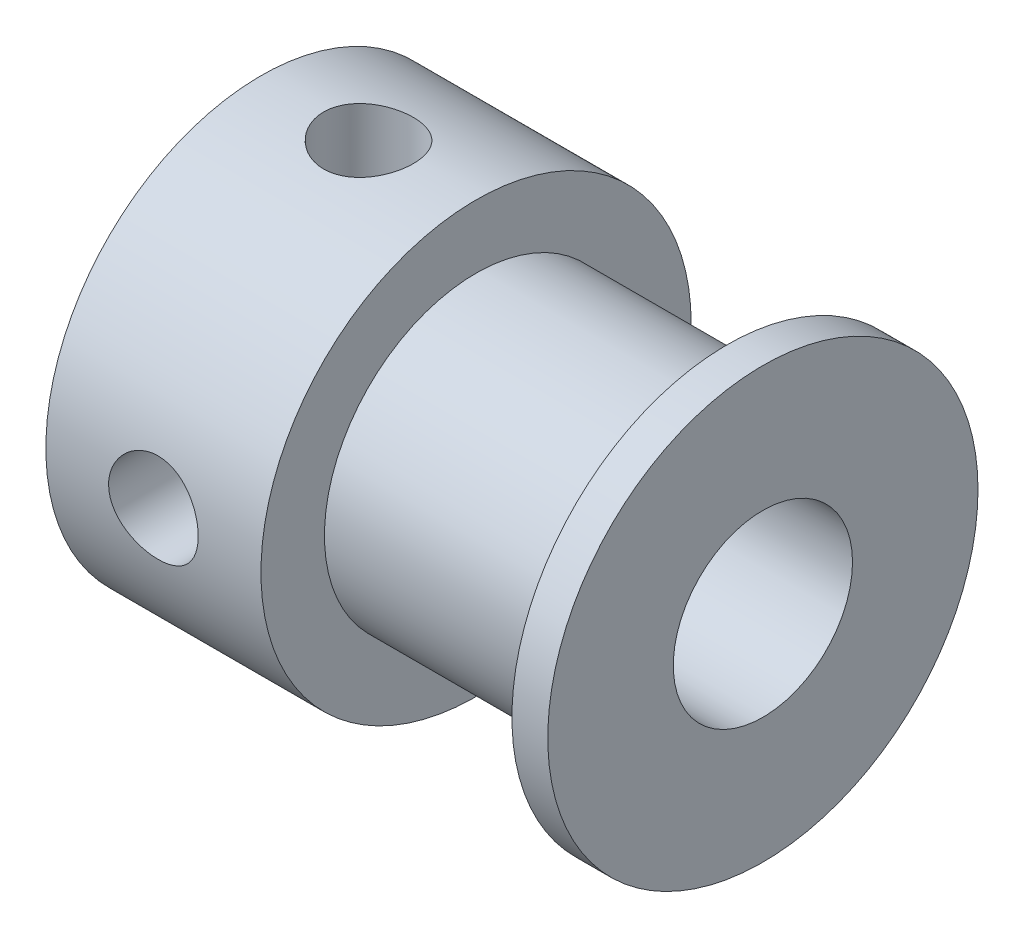
ISO-10303-21;
HEADER;
FILE_DESCRIPTION(('STEP AP214'),'2;1');
FILE_NAME('part.step','',(''),(''),'','','');
FILE_SCHEMA(('AUTOMOTIVE_DESIGN { 1 0 10303 214 1 1 1 1 }'));
ENDSEC;
DATA;
#1=APPLICATION_CONTEXT('core data for automotive mechanical design processes');
#2=APPLICATION_PROTOCOL_DEFINITION('international standard','automotive_design',2000,#1);
#3=PRODUCT_CONTEXT('',#1,'mechanical');
#4=PRODUCT('Part','Part','',(#3));
#5=PRODUCT_RELATED_PRODUCT_CATEGORY('part','',(#4));
#6=PRODUCT_DEFINITION_FORMATION('','',#4);
#7=PRODUCT_DEFINITION_CONTEXT('part definition',#1,'design');
#8=PRODUCT_DEFINITION('design','',#6,#7);
#9=PRODUCT_DEFINITION_SHAPE('','',#8);
#10=(LENGTH_UNIT() NAMED_UNIT(*) SI_UNIT(.MILLI.,.METRE.));
#11=(NAMED_UNIT(*) PLANE_ANGLE_UNIT() SI_UNIT($,.RADIAN.));
#12=(NAMED_UNIT(*) SI_UNIT($,.STERADIAN.) SOLID_ANGLE_UNIT());
#13=UNCERTAINTY_MEASURE_WITH_UNIT(LENGTH_MEASURE(1.E-05),#10,'distance_accuracy_value','');
#14=(GEOMETRIC_REPRESENTATION_CONTEXT(3) GLOBAL_UNCERTAINTY_ASSIGNED_CONTEXT((#13)) GLOBAL_UNIT_ASSIGNED_CONTEXT((#10,
#11,#12)) REPRESENTATION_CONTEXT('',''));
#15=CARTESIAN_POINT('',(0.,0.,0.));
#16=DIRECTION('',(0.,0.,1.));
#17=DIRECTION('',(1.,0.,0.));
#18=AXIS2_PLACEMENT_3D('',#15,#16,#17);
#19=CARTESIAN_POINT('',(0.,0.,0.));
#20=DIRECTION('',(1.,0.,0.));
#21=DIRECTION('',(0.,0.,-1.));
#22=AXIS2_PLACEMENT_3D('',#19,#20,#21);
#23=CYLINDRICAL_SURFACE('',#22,2.5);
#24=CARTESIAN_POINT('',(1.75000000000001,0.,2.5));
#25=CARTESIAN_POINT('',(1.75000412789938,0.0657149536912327,2.49999641755189));
#26=CARTESIAN_POINT('',(1.7552125914021,0.13150824962254,2.49738113774397));
#27=CARTESIAN_POINT('',(1.77581610042615,0.26115029408553,2.48717695046745));
#28=CARTESIAN_POINT('',(1.79123049124707,0.324995108391878,2.4795785978623));
#29=CARTESIAN_POINT('',(1.831492260771,0.448666931100716,2.4602034925414));
#30=CARTESIAN_POINT('',(1.85630298031002,0.508508503673972,2.448442989719));
#31=CARTESIAN_POINT('',(1.91446327670618,0.623090771008203,2.42182220644723));
#32=CARTESIAN_POINT('',(1.94781218031107,0.677831867487559,2.40696217041913));
#33=CARTESIAN_POINT('',(2.02439656185663,0.784384772202394,2.37445322822571));
#34=CARTESIAN_POINT('',(2.06810809904956,0.835819013902635,2.3566899890942));
#35=CARTESIAN_POINT('',(2.1631518490588,0.930974306083716,2.32074962808431));
#36=CARTESIAN_POINT('',(2.21448981471555,0.974689478883452,2.30257220261294));
#37=CARTESIAN_POINT('',(2.32810418690423,1.05656500056284,2.26623688996684));
#38=CARTESIAN_POINT('',(2.39092012293239,1.09403166943954,2.24818983712665));
#39=CARTESIAN_POINT('',(2.52295916998277,1.15771028361336,2.21607473465401));
#40=CARTESIAN_POINT('',(2.59217766090344,1.18393026870791,2.20200384508737));
#41=CARTESIAN_POINT('',(2.73083138177741,1.22266555273573,2.18072333797261));
#42=CARTESIAN_POINT('',(2.80000556508424,1.23590732135054,2.17315339479642));
#43=CARTESIAN_POINT('',(2.93997354722435,1.25053374163605,2.1647736243566));
#44=CARTESIAN_POINT('',(3.01076567608894,1.25193011046634,2.16395711679111));
#45=CARTESIAN_POINT('',(3.14285753039421,1.24335910896536,2.16888662821561));
#46=CARTESIAN_POINT('',(3.20428003902881,1.23473069942102,2.17385954577517));
#47=CARTESIAN_POINT('',(3.3246523867163,1.20867481132116,2.18845285917313));
#48=CARTESIAN_POINT('',(3.38360143163164,1.19124452987206,2.19807473539721));
#49=CARTESIAN_POINT('',(3.49903641570707,1.1477622254825,2.22109345515927));
#50=CARTESIAN_POINT('',(3.55543299848223,1.12151883389499,2.23457300829999));
#51=CARTESIAN_POINT('',(3.66329286573751,1.061302109585,2.26379255351755));
#52=CARTESIAN_POINT('',(3.71475391950011,1.02732530476558,2.27953355975239));
#53=CARTESIAN_POINT('',(3.81815156592903,0.94758256864098,2.31391447379108));
#54=CARTESIAN_POINT('',(3.86932109197019,0.900868072961596,2.33266887795933));
#55=CARTESIAN_POINT('',(3.96341927323862,0.799444473426712,2.36934529125509));
#56=CARTESIAN_POINT('',(4.00634399004235,0.744731570717852,2.38726689948501));
#57=CARTESIAN_POINT('',(4.08460707628715,0.625645632289807,2.42127484103705));
#58=CARTESIAN_POINT('',(4.11950059055717,0.560941989499257,2.43723730202509));
#59=CARTESIAN_POINT('',(4.17762128630375,0.425582769360993,2.46447351401553));
#60=CARTESIAN_POINT('',(4.20085773126895,0.354931970331593,2.47575098679441));
#61=CARTESIAN_POINT('',(4.23309425464584,0.215958114575875,2.49155417176795));
#62=CARTESIAN_POINT('',(4.24311404468347,0.147926913185404,2.4965617287664));
#63=CARTESIAN_POINT('',(4.2518309139181,0.0109744999366913,2.50091266823877));
#64=CARTESIAN_POINT('',(4.25053335704934,-0.057946274837377,2.5002587340164));
#65=CARTESIAN_POINT('',(4.23724163947655,-0.189041214982492,2.49363990316801));
#66=CARTESIAN_POINT('',(4.22608433408745,-0.251324260062442,2.48809057110237));
#67=CARTESIAN_POINT('',(4.19470241013114,-0.373008615377395,2.47277714143524));
#68=CARTESIAN_POINT('',(4.1744767919333,-0.432409607113745,2.46301257917916));
#69=CARTESIAN_POINT('',(4.12500191695853,-0.548610760562079,2.43980314267087));
#70=CARTESIAN_POINT('',(4.09551118735398,-0.605287996257689,2.42626102212424));
#71=CARTESIAN_POINT('',(4.02861558044244,-0.713076702123648,2.39679967896386));
#72=CARTESIAN_POINT('',(3.9912073317582,-0.764185787219099,2.38087944457232));
#73=CARTESIAN_POINT('',(3.9052994683339,-0.864709611613313,2.34635276671831));
#74=CARTESIAN_POINT('',(3.85607141443304,-0.913465097280795,2.32763606060552));
#75=CARTESIAN_POINT('',(3.75009356091336,-1.00232040139154,2.29077989504843));
#76=CARTESIAN_POINT('',(3.69333860147953,-1.04241423211355,2.27264084226908));
#77=CARTESIAN_POINT('',(3.57044543224961,-1.11463489312211,2.23813990282585));
#78=CARTESIAN_POINT('',(3.50398591723925,-1.14628186984829,2.2219066207934));
#79=CARTESIAN_POINT('',(3.36561241538434,-1.19760353251725,2.19467590460158));
#80=CARTESIAN_POINT('',(3.29370559187351,-1.21729364485946,2.18367172800773));
#81=CARTESIAN_POINT('',(3.15386222142319,-1.24232710931209,2.16951876260834));
#82=CARTESIAN_POINT('',(3.0862071832137,-1.24886624550107,2.16571729325614));
#83=CARTESIAN_POINT('',(2.95069116603659,-1.25086144297598,2.16456693307719));
#84=CARTESIAN_POINT('',(2.88283028907571,-1.24632230828049,2.16721524534441));
#85=CARTESIAN_POINT('',(2.75564562308498,-1.22740765699032,2.17797327562531));
#86=CARTESIAN_POINT('',(2.6961244123195,-1.21401039292849,2.18553868102992));
#87=CARTESIAN_POINT('',(2.58023985071912,-1.1789691977808,2.20463770234897));
#88=CARTESIAN_POINT('',(2.52387752238504,-1.15732261394975,2.21617259462095));
#89=CARTESIAN_POINT('',(2.41171893626674,-1.10476968162585,2.2428566295566));
#90=CARTESIAN_POINT('',(2.35621512271288,-1.07333892227057,2.25819652995239));
#91=CARTESIAN_POINT('',(2.25090682977427,-1.00268871454579,2.29044164543238));
#92=CARTESIAN_POINT('',(2.20110533685189,-0.963465214048303,2.30734767243153));
#93=CARTESIAN_POINT('',(2.10232252205298,-0.872754158330795,2.34327903949142));
#94=CARTESIAN_POINT('',(2.0541761220476,-0.820355528762707,2.36231229139336));
#95=CARTESIAN_POINT('',(1.96717127072046,-0.707693507775343,2.3984719031886));
#96=CARTESIAN_POINT('',(1.92831782571714,-0.647425904070975,2.4155972326005));
#97=CARTESIAN_POINT('',(1.86095454654725,-0.519914496024928,2.44622511981379));
#98=CARTESIAN_POINT('',(1.83251978823571,-0.452624379918263,2.45970120703636));
#99=CARTESIAN_POINT('',(1.78773979010132,-0.313427626617735,2.48126676704332));
#100=CARTESIAN_POINT('',(1.77136019146303,-0.241534749528953,2.48937154216165));
#101=CARTESIAN_POINT('',(1.7576282361552,-0.140752433104227,2.49619327387079));
#102=CARTESIAN_POINT('',(1.75477169892048,-0.112702349299371,2.49761706674002));
#103=CARTESIAN_POINT('',(1.750956668104,-0.0564396647589458,2.49952121222331));
#104=CARTESIAN_POINT('',(1.74999822691101,-0.0282270595592261,2.50000153879704));
#105=CARTESIAN_POINT('',(1.75000000000001,0.,2.5));
#106=B_SPLINE_CURVE_WITH_KNOTS('',3,(#24,#25,#26,#27,#28,#29,#30,#31,#32,#33,#34,#35,#36,#37,
#38,#39,#40,#41,#42,#43,#44,#45,#46,#47,#48,#49,#50,#51,#52,#53,#54,#55,#56,#57,#58,#59,#60,#61,
#62,#63,#64,#65,#66,#67,#68,#69,#70,#71,#72,#73,#74,#75,#76,#77,#78,#79,#80,#81,#82,#83,#84,#85,
#86,#87,#88,#89,#90,#91,#92,#93,#94,#95,#96,#97,#98,#99,#100,#101,#102,#103,#104,#105),
.UNSPECIFIED.,.T.,.F.,(4,2,2,2,2,2,2,2,2,2,2,2,2,2,2,2,2,2,2,2,2,2,2,2,2,2,2,2,2,2,2,2,2,2,2,2,
2,2,2,2,4),(0.,0.197030321775364,0.394435187136495,0.59107769436537,0.787704700726955,
0.996227198397605,1.20490779706754,1.4297715803844,1.6544743487285,1.86572515175286,
2.07676696661274,2.26257140511649,2.44843504907097,2.63862800210608,2.82890651575276,
3.04331176667346,3.25781918248356,3.48228777768049,3.70657771140347,3.9122911308918,
4.11790705639343,4.3075863313265,4.49728652038662,4.69241070034871,4.88761813435421,
5.10199513305521,5.31651985769287,5.54143352699589,5.76605639925969,5.96911634372963,
6.17208824825003,6.35572412805225,6.53941910979594,6.73545570969514,6.93159451423693,
7.15156553440619,7.37165479220712,7.59330017078652,7.81431135781158,7.89894100172117,
7.98357298143554),.UNSPECIFIED.);
#107=CARTESIAN_POINT('',(1.75000000000001,0.,2.5));
#108=VERTEX_POINT('',#107);
#109=EDGE_CURVE('E79',#108,#108,#106,.T.);
#110=ORIENTED_EDGE('',*,*,#109,.F.);
#111=EDGE_LOOP('',(#110));
#112=FACE_BOUND('',#111,.T.);
#113=CARTESIAN_POINT('',(3.,2.1650635094611,-1.25));
#114=CARTESIAN_POINT('',(3.06513476024406,2.16506918410574,-1.24999545384316));
#115=CARTESIAN_POINT('',(3.13035176440631,2.16804751484696,-1.24487496341652));
#116=CARTESIAN_POINT('',(3.25878408084644,2.17952958065066,-1.22465401237257));
#117=CARTESIAN_POINT('',(3.32199489380426,2.18804492569449,-1.20953258069272));
#118=CARTESIAN_POINT('',(3.44431458042993,2.20936683256748,-1.17012493587476));
#119=CARTESIAN_POINT('',(3.50344331559198,2.22215054341565,-1.14588744061716));
#120=CARTESIAN_POINT('',(3.6167802524959,2.25053331021072,-1.08908440672046));
#121=CARTESIAN_POINT('',(3.67098818782807,2.26613251845081,-1.05651841754472));
#122=CARTESIAN_POINT('',(3.77788216069688,2.29996086321802,-0.980833175663598));
#123=CARTESIAN_POINT('',(3.83007391959193,2.31830079547442,-0.937065045179713));
#124=CARTESIAN_POINT('',(3.92676048550839,2.35464978482132,-0.841567259518085));
#125=CARTESIAN_POINT('',(3.9712514532294,2.37265867289062,-0.789833657227866));
#126=CARTESIAN_POINT('',(4.05420893893458,2.40776846191186,-0.675611954268182));
#127=CARTESIAN_POINT('',(4.09206720982441,2.42472633022716,-0.612633986265718));
#128=CARTESIAN_POINT('',(4.1564260665572,2.45438445124411,-0.48019628324938));
#129=CARTESIAN_POINT('',(4.18293382017146,2.46708738979677,-0.410740672672694));
#130=CARTESIAN_POINT('',(4.22188082662637,2.48600576555297,-0.272556179907471));
#131=CARTESIAN_POINT('',(4.23518690794442,2.49261850276115,-0.204127238111022));
#132=CARTESIAN_POINT('',(4.2502076483438,2.50009479807584,-0.0657132858723104));
#133=CARTESIAN_POINT('',(4.25192932099464,2.50096183480737,0.00427075730467264));
#134=CARTESIAN_POINT('',(4.24406665753706,2.49703727395563,0.137290655529687));
#135=CARTESIAN_POINT('',(4.23545248059847,2.49273119865201,0.200401498970989));
#136=CARTESIAN_POINT('',(4.20889894511918,2.47967806574684,0.324142214897902));
#137=CARTESIAN_POINT('',(4.19095888877972,2.47093067582992,0.384771901367406));
#138=CARTESIAN_POINT('',(4.14614679238773,2.44964479109568,0.502886739461942));
#139=CARTESIAN_POINT('',(4.11915460853491,2.43705551911499,0.560316779393972));
#140=CARTESIAN_POINT('',(4.05717072974813,2.40922057483359,0.66997100189166));
#141=CARTESIAN_POINT('',(4.02217617087206,2.39397395196855,0.722193311048307));
#142=CARTESIAN_POINT('',(3.94138081058373,2.36055492999037,0.825217076122743));
#143=CARTESIAN_POINT('',(3.89487121459249,2.34224219997719,0.8754175937867));
#144=CARTESIAN_POINT('',(3.79426284383728,2.30567925733515,0.967630462872225));
#145=CARTESIAN_POINT('',(3.74015828465742,2.28742910332036,1.00963651446779));
#146=CARTESIAN_POINT('',(3.62168975946989,2.25180195115606,1.08688166830276));
#147=CARTESIAN_POINT('',(3.55689247118223,2.23455399988385,1.12152164372256));
#148=CARTESIAN_POINT('',(3.42132791080125,2.2046931284822,1.17914889125154));
#149=CARTESIAN_POINT('',(3.35056695872805,2.19207537557584,1.20214832276361));
#150=CARTESIAN_POINT('',(3.21098186089651,2.17430794771293,1.2339752637813));
#151=CARTESIAN_POINT('',(3.14244860119556,2.16864569810621,1.24378140264997));
#152=CARTESIAN_POINT('',(3.00449832310432,2.16397399202012,1.25189618326428));
#153=CARTESIAN_POINT('',(2.93508196360027,2.1649598361164,1.25021294664378));
#154=CARTESIAN_POINT('',(2.80543260177659,2.17292920675731,1.23629505417996));
#155=CARTESIAN_POINT('',(2.74502568611509,2.17924484383318,1.22523477089058));
#156=CARTESIAN_POINT('',(2.6270402671613,2.19617526939176,1.19462035579055));
#157=CARTESIAN_POINT('',(2.56946268656674,2.20679145006292,1.17506347327952));
#158=CARTESIAN_POINT('',(2.45573583637163,2.23170277599571,1.12705948575611));
#159=CARTESIAN_POINT('',(2.39977622893306,2.24614554053829,1.0982425796159));
#160=CARTESIAN_POINT('',(2.29316341057626,2.27695149371562,1.03285883001975));
#161=CARTESIAN_POINT('',(2.2425129456084,2.29331566693935,0.99628800541527));
#162=CARTESIAN_POINT('',(2.14127654059557,2.3285999807042,0.911046458998566));
#163=CARTESIAN_POINT('',(2.09150356160293,2.34758228942861,0.861431590393708));
#164=CARTESIAN_POINT('',(2.00073470250801,2.38417793722366,0.75425561924786));
#165=CARTESIAN_POINT('',(1.95974178721183,2.40179081259637,0.696691843319183));
#166=CARTESIAN_POINT('',(1.88678284256237,2.43426702113696,0.573169203198446));
#167=CARTESIAN_POINT('',(1.85508360223636,2.44904552090037,0.507028871967641));
#168=CARTESIAN_POINT('',(1.80357762017826,2.47354193699126,0.369402955801352));
#169=CARTESIAN_POINT('',(1.78376043579212,2.48326429595466,0.29792212674022));
#170=CARTESIAN_POINT('',(1.75828929478167,2.49584385227353,0.158724602913021));
#171=CARTESIAN_POINT('',(1.75150265515486,2.49924909885239,0.0912643048130715));
#172=CARTESIAN_POINT('',(1.748945918182,2.50052662968914,-0.0439074824390041));
#173=CARTESIAN_POINT('',(1.75317196434555,2.49840085083612,-0.111618875368858));
#174=CARTESIAN_POINT('',(1.77177050849453,2.48917461047403,-0.240672490396433));
#175=CARTESIAN_POINT('',(1.78545606157209,2.48241118334987,-0.302140397264079));
#176=CARTESIAN_POINT('',(1.82165874912871,2.46490117079279,-0.421807440229521));
#177=CARTESIAN_POINT('',(1.84417715011682,2.45415401415995,-0.480006106194385));
#178=CARTESIAN_POINT('',(1.89840881520747,2.4290741343515,-0.594279257806105));
#179=CARTESIAN_POINT('',(1.9304741540098,2.41460771498499,-0.650156428375057));
#180=CARTESIAN_POINT('',(2.00244741357381,2.38360166427283,-0.75596830226753));
#181=CARTESIAN_POINT('',(2.04235893639459,2.36706108197951,-0.805900259268633));
#182=CARTESIAN_POINT('',(2.13349642377838,2.33160762783285,-0.903642505196113));
#183=CARTESIAN_POINT('',(2.18545310934649,2.31262248764622,-0.950747105674089));
#184=CARTESIAN_POINT('',(2.29681340141221,2.27578845203566,-1.03582910924334));
#185=CARTESIAN_POINT('',(2.35622352608461,2.25794057202332,-1.07379843751257));
#186=CARTESIAN_POINT('',(2.48329580822619,2.22499506631145,-1.14053884973207));
#187=CARTESIAN_POINT('',(2.55115941391092,2.21000217820338,-1.16898133245117));
#188=CARTESIAN_POINT('',(2.69166550542472,2.1858269541044,-1.21359838688301));
#189=CARTESIAN_POINT('',(2.76429111114086,2.17662520184628,-1.22981398896918));
#190=CARTESIAN_POINT('',(2.864756694565,2.16911590752238,-1.24295875983052));
#191=CARTESIAN_POINT('',(2.89170986799735,2.1676016125644,-1.24559513120481));
#192=CARTESIAN_POINT('',(2.9457706008528,2.16557419859688,-1.24911675636245));
#193=CARTESIAN_POINT('',(2.97287817048234,2.16506114656387,-1.25000189299984));
#194=CARTESIAN_POINT('',(3.,2.1650635094611,-1.25));
#195=B_SPLINE_CURVE_WITH_KNOTS('',3,(#113,#114,#115,#116,#117,#118,#119,#120,#121,#122,#123,
#124,#125,#126,#127,#128,#129,#130,#131,#132,#133,#134,#135,#136,#137,#138,#139,#140,#141,#142,
#143,#144,#145,#146,#147,#148,#149,#150,#151,#152,#153,#154,#155,#156,#157,#158,#159,#160,#161,
#162,#163,#164,#165,#166,#167,#168,#169,#170,#171,#172,#173,#174,#175,#176,#177,#178,#179,#180,
#181,#182,#183,#184,#185,#186,#187,#188,#189,#190,#191,#192,#193,#194),.UNSPECIFIED.,.T.,.F.,(4,
2,2,2,2,2,2,2,2,2,2,2,2,2,2,2,2,2,2,2,2,2,2,2,2,2,2,2,2,2,2,2,2,2,2,2,2,2,2,2,4),(0.,
0.195290153243394,0.390991116031005,0.585660744898606,0.780340906806436,0.99107789062279,
1.20191963855464,1.42697365298454,1.65188533704864,1.86079356209919,2.0695752960755,
2.26020121855673,2.45084140646819,2.64411918413933,2.8374662418784,3.04908989321113,
3.26087560307398,3.4861105216181,3.71110967764631,3.91827863567764,4.12530116485466,
4.30967729280032,4.49411315545078,4.68709120507609,4.88016857775059,5.09758429475766,
5.31507331222752,5.53830226766207,5.76133474760964,5.96390337986858,6.16640108492464,
6.35555531089365,6.54473666890016,6.74200938399339,6.93937287625898,7.15637802312584,
7.37357428556442,7.59763436298256,7.8209391625345,7.90225168981636,7.98356965618175),.UNSPECIFIED.);
#196=CARTESIAN_POINT('',(3.,2.1650635094611,-1.25));
#197=VERTEX_POINT('',#196);
#198=EDGE_CURVE('E72',#197,#197,#195,.T.);
#199=ORIENTED_EDGE('',*,*,#198,.F.);
#200=EDGE_LOOP('',(#199));
#201=FACE_BOUND('',#200,.T.);
#202=CARTESIAN_POINT('',(14.,0.,0.));
#203=DIRECTION('',(1.,0.,0.));
#204=DIRECTION('',(0.,0.,-1.));
#205=AXIS2_PLACEMENT_3D('',#202,#203,#204);
#206=CIRCLE('',#205,2.5);
#207=CARTESIAN_POINT('',(14.,0.,-2.5));
#208=VERTEX_POINT('',#207);
#209=EDGE_CURVE('E78',#208,#208,#206,.T.);
#210=ORIENTED_EDGE('',*,*,#209,.T.);
#211=EDGE_LOOP('',(#210));
#212=FACE_BOUND('',#211,.T.);
#213=CARTESIAN_POINT('',(0.,0.,0.));
#214=DIRECTION('',(1.,0.,0.));
#215=DIRECTION('',(0.,0.,-1.));
#216=AXIS2_PLACEMENT_3D('',#213,#214,#215);
#217=CIRCLE('',#216,2.5);
#218=CARTESIAN_POINT('',(0.,0.,-2.5));
#219=VERTEX_POINT('',#218);
#220=EDGE_CURVE('E48',#219,#219,#217,.T.);
#221=ORIENTED_EDGE('',*,*,#220,.F.);
#222=EDGE_LOOP('',(#221));
#223=FACE_BOUND('',#222,.T.);
#224=ADVANCED_FACE('F33',(#112,#201,#212,#223),#23,.F.);
#225=CARTESIAN_POINT('',(0.,2.5,0.));
#226=DIRECTION('',(-1.,0.,0.));
#227=DIRECTION('',(0.,0.,1.));
#228=AXIS2_PLACEMENT_3D('',#225,#226,#227);
#229=PLANE('',#228);
#230=ORIENTED_EDGE('',*,*,#220,.T.);
#231=EDGE_LOOP('',(#230));
#232=FACE_BOUND('',#231,.T.);
#233=CARTESIAN_POINT('',(0.,0.,0.));
#234=DIRECTION('',(1.,0.,0.));
#235=DIRECTION('',(0.,0.,-1.));
#236=AXIS2_PLACEMENT_3D('',#233,#234,#235);
#237=CIRCLE('',#236,6.);
#238=CARTESIAN_POINT('',(0.,0.,-6.));
#239=VERTEX_POINT('',#238);
#240=EDGE_CURVE('E52',#239,#239,#237,.T.);
#241=ORIENTED_EDGE('',*,*,#240,.F.);
#242=EDGE_LOOP('',(#241));
#243=FACE_BOUND('',#242,.T.);
#244=ADVANCED_FACE('F103',(#232,#243),#229,.T.);
#245=CARTESIAN_POINT('',(0.,0.,0.));
#246=DIRECTION('',(1.,0.,0.));
#247=DIRECTION('',(0.,0.,-1.));
#248=AXIS2_PLACEMENT_3D('',#245,#246,#247);
#249=CYLINDRICAL_SURFACE('',#248,6.);
#250=CARTESIAN_POINT('',(1.75000000000001,0.,6.));
#251=CARTESIAN_POINT('',(1.75000247746923,-0.0694090417016603,5.99999871526651));
#252=CARTESIAN_POINT('',(1.75580066571876,-0.138848789520875,5.99878328775043));
#253=CARTESIAN_POINT('',(1.77881934953286,-0.275761316266992,5.99405200990679));
#254=CARTESIAN_POINT('',(1.79604852303694,-0.343232560128311,5.99053441189248));
#255=CARTESIAN_POINT('',(1.84137045492183,-0.474209132291339,5.98159109196202));
#256=CARTESIAN_POINT('',(1.86945239599889,-0.537718336709182,5.97616727052645));
#257=CARTESIAN_POINT('',(1.93564960885619,-0.659120328605954,5.96399927809859));
#258=CARTESIAN_POINT('',(1.97376443115584,-0.717013367534323,5.95725516625975));
#259=CARTESIAN_POINT('',(2.05953634019065,-0.826390324308832,5.9430770002465));
#260=CARTESIAN_POINT('',(2.10731200123509,-0.87778024416268,5.93563505848531));
#261=CARTESIAN_POINT('',(2.21079465919511,-0.971877776769387,5.92095657692448));
#262=CARTESIAN_POINT('',(2.26650231187227,-1.01458467096098,5.91372005416683));
#263=CARTESIAN_POINT('',(2.38495196876616,-1.09051031677216,5.90019442595308));
#264=CARTESIAN_POINT('',(2.44775838450275,-1.1236305468065,5.89391545174828));
#265=CARTESIAN_POINT('',(2.57819745177276,-1.17881119348063,5.8831284065002));
#266=CARTESIAN_POINT('',(2.64582958244254,-1.20087280167641,5.87862014467568));
#267=CARTESIAN_POINT('',(2.78298523741564,-1.23300240133736,5.87196500986123));
#268=CARTESIAN_POINT('',(2.85246835933477,-1.24323597696798,5.86978556855865));
#269=CARTESIAN_POINT('',(2.99219684286263,-1.25193357655614,5.86793690716491));
#270=CARTESIAN_POINT('',(3.0624421188653,-1.25039890894686,5.86826740800981));
#271=CARTESIAN_POINT('',(3.20048102797518,-1.23573719037196,5.87137174319175));
#272=CARTESIAN_POINT('',(3.26829597966121,-1.2228010523272,5.87410533679901));
#273=CARTESIAN_POINT('',(3.40077150964492,-1.18600543529945,5.88164437615942));
#274=CARTESIAN_POINT('',(3.46543192560633,-1.16214539481381,5.88644992841317));
#275=CARTESIAN_POINT('',(3.59030722841598,-1.10400003213928,5.89763191464102));
#276=CARTESIAN_POINT('',(3.65048629652707,-1.06964002534236,5.90401953785586));
#277=CARTESIAN_POINT('',(3.76429574426816,-0.991522699274812,5.91763890010721));
#278=CARTESIAN_POINT('',(3.81792530883597,-0.947764212262582,5.92487074398537));
#279=CARTESIAN_POINT('',(3.91821396108037,-0.851074921546778,5.93953730929909));
#280=CARTESIAN_POINT('',(3.96471616889701,-0.797981433412078,5.94697323199473));
#281=CARTESIAN_POINT('',(4.04818044222897,-0.684667288611794,5.96108088143001));
#282=CARTESIAN_POINT('',(4.08514236459839,-0.624446525025762,5.96775259670236));
#283=CARTESIAN_POINT('',(4.14851008153595,-0.498405541235476,5.97959870942815));
#284=CARTESIAN_POINT('',(4.17489680456711,-0.432575461926497,5.98477039710258));
#285=CARTESIAN_POINT('',(4.21619170483549,-0.297284620972153,5.99301338211281));
#286=CARTESIAN_POINT('',(4.23110139323139,-0.227824338595088,5.99608495596053));
#287=CARTESIAN_POINT('',(4.24879425206788,-0.0885918657008341,5.99974275215455));
#288=CARTESIAN_POINT('',(4.25179194149424,-0.018848055526178,6.00037293537579));
#289=CARTESIAN_POINT('',(4.24615505003089,0.120143798757714,5.99919952252774));
#290=CARTESIAN_POINT('',(4.2375211813984,0.189391872962257,5.99739607548153));
#291=CARTESIAN_POINT('',(4.20904434653046,0.324726367119812,5.99158564979184));
#292=CARTESIAN_POINT('',(4.18931251461653,0.390837192894204,5.98760052868077));
#293=CARTESIAN_POINT('',(4.13932213957859,0.518811446661329,5.97787227242395));
#294=CARTESIAN_POINT('',(4.10906275913401,0.580674536336772,5.97212899744579));
#295=CARTESIAN_POINT('',(4.03841962176243,0.699294306943491,5.95941241490714));
#296=CARTESIAN_POINT('',(3.99790807043093,0.755973219469831,5.9524239381233));
#297=CARTESIAN_POINT('',(3.90808043692372,0.861805445886516,5.93802568299709));
#298=CARTESIAN_POINT('',(3.85876332448105,0.910957877913282,5.93061585542511));
#299=CARTESIAN_POINT('',(3.7517444230003,1.0011786486518,5.91606024531377));
#300=CARTESIAN_POINT('',(3.69391696804471,1.04209914600204,5.90892089307501));
#301=CARTESIAN_POINT('',(3.57208371578621,1.11364719079243,5.89585601015805));
#302=CARTESIAN_POINT('',(3.50807817586089,1.14427516677863,5.88993042894651));
#303=CARTESIAN_POINT('',(3.37603880370177,1.19417246443921,5.88001700708041));
#304=CARTESIAN_POINT('',(3.30802896283416,1.21350309828031,5.87601872784687));
#305=CARTESIAN_POINT('',(3.16963344950774,1.24044038523407,5.87039184709697));
#306=CARTESIAN_POINT('',(3.09924811838056,1.2480487154444,5.86876290660367));
#307=CARTESIAN_POINT('',(2.95958659900035,1.25125926487611,5.86807907308506));
#308=CARTESIAN_POINT('',(2.89031592977795,1.24709542622725,5.86897402321502));
#309=CARTESIAN_POINT('',(2.75348599107978,1.22739905314031,5.87312447254928));
#310=CARTESIAN_POINT('',(2.6859267051839,1.21186662782265,5.87637994909626));
#311=CARTESIAN_POINT('',(2.55460222810934,1.16998217768584,5.88486132447716));
#312=CARTESIAN_POINT('',(2.49082675351308,1.14366117568421,5.8900815700793));
#313=CARTESIAN_POINT('',(2.36856122397334,1.08097457299757,5.90190705738738));
#314=CARTESIAN_POINT('',(2.31007166036688,1.04460803983029,5.9085124276546));
#315=CARTESIAN_POINT('',(2.19887837292056,0.962073695342405,5.92251579551146));
#316=CARTESIAN_POINT('',(2.14630087543502,0.915737890418221,5.92992613868404));
#317=CARTESIAN_POINT('',(2.04959050677365,0.81492443811533,5.94461839583213));
#318=CARTESIAN_POINT('',(2.00545958244852,0.760444918832964,5.9519002798488));
#319=CARTESIAN_POINT('',(1.92641142681595,0.644134427507699,5.96561444547637));
#320=CARTESIAN_POINT('',(1.89160632011372,0.582225921521345,5.97203596073244));
#321=CARTESIAN_POINT('',(1.83294977156998,0.453319843998451,5.98319908494092));
#322=CARTESIAN_POINT('',(1.80908875281813,0.386326781907242,5.98794216182101));
#323=CARTESIAN_POINT('',(1.77745972171158,0.266015292900104,5.99432499781443));
#324=CARTESIAN_POINT('',(1.76718123679115,0.213367593727928,5.99644035661395));
#325=CARTESIAN_POINT('',(1.75345054572268,0.107152674176536,5.99927832789758));
#326=CARTESIAN_POINT('',(1.74999808733281,0.0535854878488716,6.00000099184586));
#327=CARTESIAN_POINT('',(1.75000000000001,0.,6.));
#328=B_SPLINE_CURVE_WITH_KNOTS('',3,(#250,#251,#252,#253,#254,#255,#256,#257,#258,#259,#260,
#261,#262,#263,#264,#265,#266,#267,#268,#269,#270,#271,#272,#273,#274,#275,#276,#277,#278,#279,
#280,#281,#282,#283,#284,#285,#286,#287,#288,#289,#290,#291,#292,#293,#294,#295,#296,#297,#298,
#299,#300,#301,#302,#303,#304,#305,#306,#307,#308,#309,#310,#311,#312,#313,#314,#315,#316,#317,
#318,#319,#320,#321,#322,#323,#324,#325,#326,#327),.UNSPECIFIED.,.T.,.F.,(4,2,2,2,2,2,2,2,2,2,2,
2,2,2,2,2,2,2,2,2,2,2,2,2,2,2,2,2,2,2,2,2,2,2,2,2,2,2,4),(0.,0.208031045103182,
0.416220199906223,0.624202378825439,0.832175241572985,1.04287526388122,1.25359271551785,
1.46640449178548,1.67919333285489,1.88896575169853,2.09871484767163,2.30501712129058,
2.51133000030278,2.71914592416748,2.92698768368033,3.13889526355464,3.35080602278216,
3.56309724499661,3.77536051045769,3.98378339407673,4.19219351552275,4.39855286632619,
4.60492863390931,4.81401583995734,5.02312752564571,5.23571263829333,5.44828889851306,
5.65970050095022,5.87108185414182,6.07829223291035,6.28550062281358,6.49211731393252,
6.69875319081476,6.90919024830305,7.11967575117366,7.33258864398252,7.54531486464969,
7.70592588477276,7.86653096973387),.UNSPECIFIED.);
#329=CARTESIAN_POINT('',(1.75000000000001,0.,6.));
#330=VERTEX_POINT('',#329);
#331=EDGE_CURVE('E10',#330,#330,#328,.T.);
#332=ORIENTED_EDGE('',*,*,#331,.F.);
#333=EDGE_LOOP('',(#332));
#334=FACE_BOUND('',#333,.T.);
#335=CARTESIAN_POINT('',(4.25,6.,0.));
#336=CARTESIAN_POINT('',(4.24999752253078,5.99999871526651,-0.0694090417016606));
#337=CARTESIAN_POINT('',(4.24419933428125,5.99878328775043,-0.138848789520875));
#338=CARTESIAN_POINT('',(4.22118065046715,5.99405200990679,-0.275761316266993));
#339=CARTESIAN_POINT('',(4.20395147696307,5.99053441189248,-0.343232560128312));
#340=CARTESIAN_POINT('',(4.15862954507818,5.98159109196202,-0.474209132291342));
#341=CARTESIAN_POINT('',(4.13054760400111,5.97616727052645,-0.537718336709185));
#342=CARTESIAN_POINT('',(4.06435039114382,5.96399927809859,-0.659120328605958));
#343=CARTESIAN_POINT('',(4.02623556884417,5.95725516625975,-0.717013367534327));
#344=CARTESIAN_POINT('',(3.94046365980936,5.9430770002465,-0.826390324308836));
#345=CARTESIAN_POINT('',(3.89268799876492,5.93563505848531,-0.877780244162685));
#346=CARTESIAN_POINT('',(3.78920534080489,5.92095657692448,-0.971877776769392));
#347=CARTESIAN_POINT('',(3.73349768812774,5.91372005416683,-1.01458467096099));
#348=CARTESIAN_POINT('',(3.61504803123384,5.90019442595308,-1.09051031677217));
#349=CARTESIAN_POINT('',(3.55224161549726,5.89391545174828,-1.12363054680651));
#350=CARTESIAN_POINT('',(3.42180254822724,5.8831284065002,-1.17881119348064));
#351=CARTESIAN_POINT('',(3.35417041755746,5.87862014467568,-1.20087280167641));
#352=CARTESIAN_POINT('',(3.21701476258436,5.87196500986122,-1.23300240133737));
#353=CARTESIAN_POINT('',(3.14753164066523,5.86978556855865,-1.24323597696799));
#354=CARTESIAN_POINT('',(3.00780315713737,5.86793690716491,-1.25193357655615));
#355=CARTESIAN_POINT('',(2.9375578811347,5.86826740800981,-1.25039890894687));
#356=CARTESIAN_POINT('',(2.79951897202482,5.87137174319175,-1.23573719037197));
#357=CARTESIAN_POINT('',(2.73170402033879,5.87410533679901,-1.2228010523272));
#358=CARTESIAN_POINT('',(2.59922849035507,5.88164437615942,-1.18600543529945));
#359=CARTESIAN_POINT('',(2.53456807439367,5.88644992841317,-1.16214539481382));
#360=CARTESIAN_POINT('',(2.40969277158402,5.89763191464102,-1.10400003213928));
#361=CARTESIAN_POINT('',(2.34951370347293,5.90401953785586,-1.06964002534237));
#362=CARTESIAN_POINT('',(2.23570425573184,5.91763890010721,-0.991522699274817));
#363=CARTESIAN_POINT('',(2.18207469116402,5.92487074398537,-0.947764212262587));
#364=CARTESIAN_POINT('',(2.08178603891963,5.93953730929909,-0.851074921546782));
#365=CARTESIAN_POINT('',(2.03528383110299,5.94697323199473,-0.797981433412082));
#366=CARTESIAN_POINT('',(1.95181955777103,5.96108088143001,-0.684667288611798));
#367=CARTESIAN_POINT('',(1.9148576354016,5.96775259670236,-0.624446525025765));
#368=CARTESIAN_POINT('',(1.85148991846405,5.97959870942815,-0.498405541235478));
#369=CARTESIAN_POINT('',(1.82510319543288,5.98477039710258,-0.432575461926499));
#370=CARTESIAN_POINT('',(1.78380829516451,5.99301338211281,-0.297284620972155));
#371=CARTESIAN_POINT('',(1.7688986067686,5.99608495596053,-0.227824338595089));
#372=CARTESIAN_POINT('',(1.75120574793212,5.99974275215455,-0.0885918657008347));
#373=CARTESIAN_POINT('',(1.74820805850575,6.00037293537579,-0.0188480555261782));
#374=CARTESIAN_POINT('',(1.7538449499691,5.99919952252774,0.120143798757715));
#375=CARTESIAN_POINT('',(1.7624788186016,5.99739607548153,0.189391872962258));
#376=CARTESIAN_POINT('',(1.79095565346953,5.99158564979184,0.324726367119814));
#377=CARTESIAN_POINT('',(1.81068748538347,5.98760052868077,0.390837192894206));
#378=CARTESIAN_POINT('',(1.86067786042141,5.97787227242395,0.518811446661331));
#379=CARTESIAN_POINT('',(1.89093724086598,5.97212899744579,0.580674536336775));
#380=CARTESIAN_POINT('',(1.96158037823756,5.95941241490714,0.699294306943494));
#381=CARTESIAN_POINT('',(2.00209192956906,5.9524239381233,0.755973219469834));
#382=CARTESIAN_POINT('',(2.09191956307627,5.93802568299709,0.86180544588652));
#383=CARTESIAN_POINT('',(2.14123667551894,5.93061585542511,0.910957877913286));
#384=CARTESIAN_POINT('',(2.2482555769997,5.91606024531377,1.0011786486518));
#385=CARTESIAN_POINT('',(2.30608303195528,5.90892089307501,1.04209914600204));
#386=CARTESIAN_POINT('',(2.42791628421379,5.89585601015805,1.11364719079243));
#387=CARTESIAN_POINT('',(2.49192182413911,5.88993042894651,1.14427516677864));
#388=CARTESIAN_POINT('',(2.62396119629823,5.88001700708041,1.19417246443922));
#389=CARTESIAN_POINT('',(2.69197103716584,5.87601872784687,1.21350309828032));
#390=CARTESIAN_POINT('',(2.83036655049226,5.87039184709697,1.24044038523407));
#391=CARTESIAN_POINT('',(2.90075188161944,5.86876290660367,1.24804871544441));
#392=CARTESIAN_POINT('',(3.04041340099965,5.86807907308506,1.25125926487611));
#393=CARTESIAN_POINT('',(3.10968407022205,5.86897402321502,1.24709542622725));
#394=CARTESIAN_POINT('',(3.24651400892022,5.87312447254927,1.22739905314032));
#395=CARTESIAN_POINT('',(3.31407329481611,5.87637994909626,1.21186662782266));
#396=CARTESIAN_POINT('',(3.44539777189066,5.88486132447716,1.16998217768585));
#397=CARTESIAN_POINT('',(3.50917324648693,5.8900815700793,1.14366117568421));
#398=CARTESIAN_POINT('',(3.63143877602667,5.90190705738738,1.08097457299757));
#399=CARTESIAN_POINT('',(3.68992833963313,5.9085124276546,1.0446080398303));
#400=CARTESIAN_POINT('',(3.80112162707945,5.92251579551146,0.96207369534241));
#401=CARTESIAN_POINT('',(3.85369912456498,5.92992613868404,0.915737890418225));
#402=CARTESIAN_POINT('',(3.95040949322636,5.94461839583213,0.814924438115334));
#403=CARTESIAN_POINT('',(3.99454041755149,5.9519002798488,0.760444918832967));
#404=CARTESIAN_POINT('',(4.07358857318406,5.96561444547637,0.644134427507703));
#405=CARTESIAN_POINT('',(4.10839367988629,5.97203596073244,0.582225921521348));
#406=CARTESIAN_POINT('',(4.16705022843002,5.98319908494092,0.453319843998453));
#407=CARTESIAN_POINT('',(4.19091124718187,5.98794216182101,0.386326781907243));
#408=CARTESIAN_POINT('',(4.22254027828842,5.99432499781443,0.266015292900104));
#409=CARTESIAN_POINT('',(4.23281876320886,5.99644035661395,0.213367593727928));
#410=CARTESIAN_POINT('',(4.24654945427733,5.99927832789758,0.107152674176537));
#411=CARTESIAN_POINT('',(4.25000191266719,6.00000099184586,0.0535854878488716));
#412=CARTESIAN_POINT('',(4.25,6.,0.));
#413=B_SPLINE_CURVE_WITH_KNOTS('',3,(#335,#336,#337,#338,#339,#340,#341,#342,#343,#344,#345,
#346,#347,#348,#349,#350,#351,#352,#353,#354,#355,#356,#357,#358,#359,#360,#361,#362,#363,#364,
#365,#366,#367,#368,#369,#370,#371,#372,#373,#374,#375,#376,#377,#378,#379,#380,#381,#382,#383,
#384,#385,#386,#387,#388,#389,#390,#391,#392,#393,#394,#395,#396,#397,#398,#399,#400,#401,#402,
#403,#404,#405,#406,#407,#408,#409,#410,#411,#412),.UNSPECIFIED.,.T.,.F.,(4,2,2,2,2,2,2,2,2,2,2,
2,2,2,2,2,2,2,2,2,2,2,2,2,2,2,2,2,2,2,2,2,2,2,2,2,2,2,4),(0.,0.208031045103183,
0.416220199906225,0.624202378825443,0.832175241572989,1.04287526388123,1.25359271551786,
1.46640449178548,1.6791933328549,1.88896575169854,2.09871484767164,2.30501712129059,
2.5113300003028,2.71914592416749,2.92698768368034,3.13889526355466,3.35080602278218,
3.56309724499662,3.77536051045771,3.98378339407675,4.19219351552277,4.39855286632621,
4.60492863390933,4.81401583995737,5.02312752564574,5.23571263829336,5.44828889851309,
5.65970050095025,5.87108185414185,6.07829223291038,6.28550062281361,6.49211731393255,
6.6987531908148,6.90919024830309,7.11967575117369,7.33258864398256,7.54531486464973,
7.7059258847728,7.86653096973391),.UNSPECIFIED.);
#414=CARTESIAN_POINT('',(4.25,6.,0.));
#415=VERTEX_POINT('',#414);
#416=EDGE_CURVE('E44',#415,#415,#413,.T.);
#417=ORIENTED_EDGE('',*,*,#416,.F.);
#418=EDGE_LOOP('',(#417));
#419=FACE_BOUND('',#418,.T.);
#420=ORIENTED_EDGE('',*,*,#240,.T.);
#421=EDGE_LOOP('',(#420));
#422=FACE_BOUND('',#421,.T.);
#423=CARTESIAN_POINT('',(6.,0.,0.));
#424=DIRECTION('',(1.,0.,0.));
#425=DIRECTION('',(0.,0.,-1.));
#426=AXIS2_PLACEMENT_3D('',#423,#424,#425);
#427=CIRCLE('',#426,6.);
#428=CARTESIAN_POINT('',(6.,0.,-6.));
#429=VERTEX_POINT('',#428);
#430=EDGE_CURVE('E96',#429,#429,#427,.T.);
#431=ORIENTED_EDGE('',*,*,#430,.F.);
#432=EDGE_LOOP('',(#431));
#433=FACE_BOUND('',#432,.T.);
#434=ADVANCED_FACE('F58',(#334,#419,#422,#433),#249,.T.);
#435=CARTESIAN_POINT('',(6.,6.,0.));
#436=DIRECTION('',(1.,0.,0.));
#437=DIRECTION('',(0.,0.,-1.));
#438=AXIS2_PLACEMENT_3D('',#435,#436,#437);
#439=PLANE('',#438);
#440=ORIENTED_EDGE('',*,*,#430,.T.);
#441=EDGE_LOOP('',(#440));
#442=FACE_BOUND('',#441,.T.);
#443=CARTESIAN_POINT('',(6.,0.,0.));
#444=DIRECTION('',(1.,0.,0.));
#445=DIRECTION('',(0.,0.,-1.));
#446=AXIS2_PLACEMENT_3D('',#443,#444,#445);
#447=CIRCLE('',#446,4.2291);
#448=CARTESIAN_POINT('',(6.,0.,-4.2291));
#449=VERTEX_POINT('',#448);
#450=EDGE_CURVE('E93',#449,#449,#447,.T.);
#451=ORIENTED_EDGE('',*,*,#450,.F.);
#452=EDGE_LOOP('',(#451));
#453=FACE_BOUND('',#452,.T.);
#454=ADVANCED_FACE('F110',(#442,#453),#439,.T.);
#455=CARTESIAN_POINT('',(0.,0.,0.));
#456=DIRECTION('',(1.,0.,0.));
#457=DIRECTION('',(0.,0.,-1.));
#458=AXIS2_PLACEMENT_3D('',#455,#456,#457);
#459=CYLINDRICAL_SURFACE('',#458,4.2291);
#460=ORIENTED_EDGE('',*,*,#450,.T.);
#461=EDGE_LOOP('',(#460));
#462=FACE_BOUND('',#461,.T.);
#463=CARTESIAN_POINT('',(13.,0.,0.));
#464=DIRECTION('',(1.,0.,0.));
#465=DIRECTION('',(0.,0.,-1.));
#466=AXIS2_PLACEMENT_3D('',#463,#464,#465);
#467=CIRCLE('',#466,4.2291);
#468=CARTESIAN_POINT('',(13.,0.,-4.2291));
#469=VERTEX_POINT('',#468);
#470=EDGE_CURVE('E90',#469,#469,#467,.T.);
#471=ORIENTED_EDGE('',*,*,#470,.F.);
#472=EDGE_LOOP('',(#471));
#473=FACE_BOUND('',#472,.T.);
#474=ADVANCED_FACE('F137',(#462,#473),#459,.T.);
#475=CARTESIAN_POINT('',(13.,4.2291,0.));
#476=DIRECTION('',(-1.,0.,0.));
#477=DIRECTION('',(0.,0.,1.));
#478=AXIS2_PLACEMENT_3D('',#475,#476,#477);
#479=PLANE('',#478);
#480=ORIENTED_EDGE('',*,*,#470,.T.);
#481=EDGE_LOOP('',(#480));
#482=FACE_BOUND('',#481,.T.);
#483=CARTESIAN_POINT('',(13.,0.,0.));
#484=DIRECTION('',(1.,0.,0.));
#485=DIRECTION('',(0.,0.,-1.));
#486=AXIS2_PLACEMENT_3D('',#483,#484,#485);
#487=CIRCLE('',#486,6.);
#488=CARTESIAN_POINT('',(13.,0.,-6.));
#489=VERTEX_POINT('',#488);
#490=EDGE_CURVE('E87',#489,#489,#487,.T.);
#491=ORIENTED_EDGE('',*,*,#490,.F.);
#492=EDGE_LOOP('',(#491));
#493=FACE_BOUND('',#492,.T.);
#494=ADVANCED_FACE('F130',(#482,#493),#479,.T.);
#495=CARTESIAN_POINT('',(0.,0.,0.));
#496=DIRECTION('',(1.,0.,0.));
#497=DIRECTION('',(0.,0.,-1.));
#498=AXIS2_PLACEMENT_3D('',#495,#496,#497);
#499=CYLINDRICAL_SURFACE('',#498,6.);
#500=ORIENTED_EDGE('',*,*,#490,.T.);
#501=EDGE_LOOP('',(#500));
#502=FACE_BOUND('',#501,.T.);
#503=CARTESIAN_POINT('',(14.,0.,0.));
#504=DIRECTION('',(1.,0.,0.));
#505=DIRECTION('',(0.,0.,-1.));
#506=AXIS2_PLACEMENT_3D('',#503,#504,#505);
#507=CIRCLE('',#506,6.);
#508=CARTESIAN_POINT('',(14.,0.,-6.));
#509=VERTEX_POINT('',#508);
#510=EDGE_CURVE('E84',#509,#509,#507,.T.);
#511=ORIENTED_EDGE('',*,*,#510,.F.);
#512=EDGE_LOOP('',(#511));
#513=FACE_BOUND('',#512,.T.);
#514=ADVANCED_FACE('F125',(#502,#513),#499,.T.);
#515=CARTESIAN_POINT('',(14.,6.,0.));
#516=DIRECTION('',(1.,0.,0.));
#517=DIRECTION('',(0.,0.,-1.));
#518=AXIS2_PLACEMENT_3D('',#515,#516,#517);
#519=PLANE('',#518);
#520=ORIENTED_EDGE('',*,*,#510,.T.);
#521=EDGE_LOOP('',(#520));
#522=FACE_BOUND('',#521,.T.);
#523=ORIENTED_EDGE('',*,*,#209,.F.);
#524=EDGE_LOOP('',(#523));
#525=FACE_BOUND('',#524,.T.);
#526=ADVANCED_FACE('F66',(#522,#525),#519,.T.);
#527=CARTESIAN_POINT('',(3.,0.,0.));
#528=DIRECTION('',(0.,-1.,0.));
#529=DIRECTION('',(0.,0.,-1.));
#530=AXIS2_PLACEMENT_3D('',#527,#528,#529);
#531=CYLINDRICAL_SURFACE('',#530,1.25);
#532=ORIENTED_EDGE('',*,*,#198,.T.);
#533=EDGE_LOOP('',(#532));
#534=FACE_BOUND('',#533,.T.);
#535=ORIENTED_EDGE('',*,*,#416,.T.);
#536=EDGE_LOOP('',(#535));
#537=FACE_BOUND('',#536,.T.);
#538=ADVANCED_FACE('F61',(#534,#537),#531,.F.);
#539=CARTESIAN_POINT('',(3.,0.,0.));
#540=DIRECTION('',(0.,0.,-1.));
#541=DIRECTION('',(-1.,0.,0.));
#542=AXIS2_PLACEMENT_3D('',#539,#540,#541);
#543=CYLINDRICAL_SURFACE('',#542,1.24999999999999);
#544=ORIENTED_EDGE('',*,*,#109,.T.);
#545=EDGE_LOOP('',(#544));
#546=FACE_BOUND('',#545,.T.);
#547=ORIENTED_EDGE('',*,*,#331,.T.);
#548=EDGE_LOOP('',(#547));
#549=FACE_BOUND('',#548,.T.);
#550=ADVANCED_FACE('F65',(#546,#549),#543,.F.);
#551=CLOSED_SHELL('',(#224,#244,#434,#454,#474,#494,#514,#526,#538,#550));
#552=MANIFOLD_SOLID_BREP('B2',#551);
#553=ADVANCED_BREP_SHAPE_REPRESENTATION('',(#18,#552),#14);
#554=SHAPE_DEFINITION_REPRESENTATION(#9,#553);
ENDSEC;
END-ISO-10303-21;
